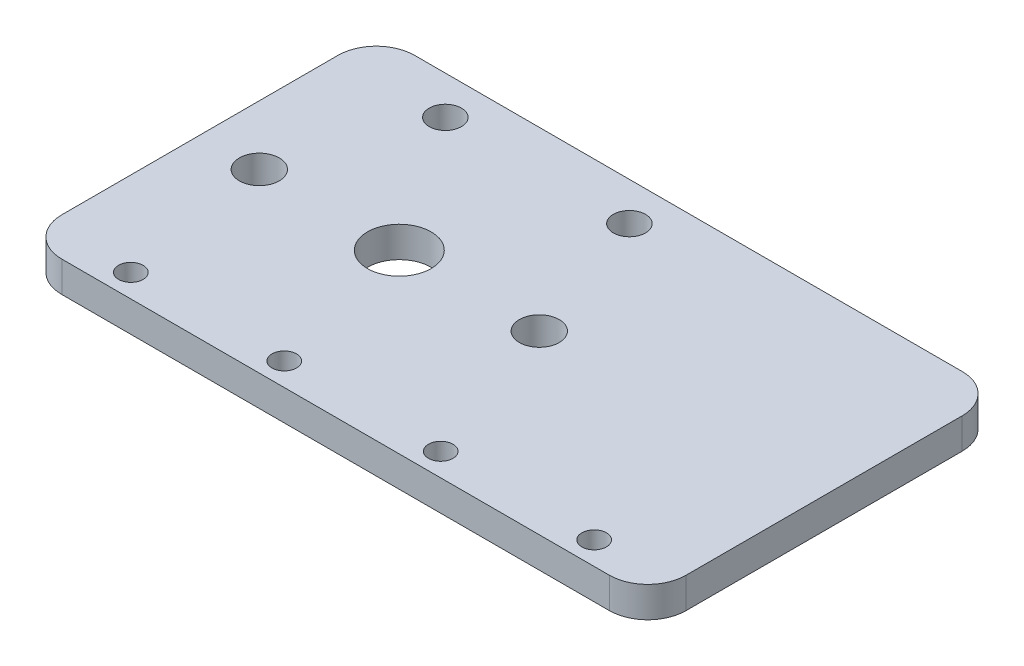
ISO-10303-21;
HEADER;
FILE_DESCRIPTION(('STEP AP214'),'2;1');
FILE_NAME('part.step','',(''),(''),'','','');
FILE_SCHEMA(('AUTOMOTIVE_DESIGN { 1 0 10303 214 1 1 1 1 }'));
ENDSEC;
DATA;
#1=APPLICATION_CONTEXT('core data for automotive mechanical design processes');
#2=APPLICATION_PROTOCOL_DEFINITION('international standard','automotive_design',2000,#1);
#3=PRODUCT_CONTEXT('',#1,'mechanical');
#4=PRODUCT('Part','Part','',(#3));
#5=PRODUCT_RELATED_PRODUCT_CATEGORY('part','',(#4));
#6=PRODUCT_DEFINITION_FORMATION('','',#4);
#7=PRODUCT_DEFINITION_CONTEXT('part definition',#1,'design');
#8=PRODUCT_DEFINITION('design','',#6,#7);
#9=PRODUCT_DEFINITION_SHAPE('','',#8);
#10=(LENGTH_UNIT() NAMED_UNIT(*) SI_UNIT(.MILLI.,.METRE.));
#11=(NAMED_UNIT(*) PLANE_ANGLE_UNIT() SI_UNIT($,.RADIAN.));
#12=(NAMED_UNIT(*) SI_UNIT($,.STERADIAN.) SOLID_ANGLE_UNIT());
#13=UNCERTAINTY_MEASURE_WITH_UNIT(LENGTH_MEASURE(1.E-05),#10,'distance_accuracy_value','');
#14=(GEOMETRIC_REPRESENTATION_CONTEXT(3) GLOBAL_UNCERTAINTY_ASSIGNED_CONTEXT((#13)) GLOBAL_UNIT_ASSIGNED_CONTEXT((#10,
#11,#12)) REPRESENTATION_CONTEXT('',''));
#15=CARTESIAN_POINT('',(0.,0.,0.));
#16=DIRECTION('',(0.,0.,1.));
#17=DIRECTION('',(1.,0.,0.));
#18=AXIS2_PLACEMENT_3D('',#15,#16,#17);
#19=CARTESIAN_POINT('',(0.,4.,0.));
#20=DIRECTION('',(0.,-1.,0.));
#21=DIRECTION('',(0.,0.,-1.));
#22=AXIS2_PLACEMENT_3D('',#19,#20,#21);
#23=PLANE('',#22);
#24=CARTESIAN_POINT('',(-15.0000000000049,4.,19.9999999999977));
#25=DIRECTION('',(0.,-1.,0.));
#26=DIRECTION('',(0.,0.,-1.));
#27=AXIS2_PLACEMENT_3D('',#24,#25,#26);
#28=CIRCLE('',#27,1.6);
#29=CARTESIAN_POINT('',(-15.0000000000049,4.,18.3999999999977));
#30=VERTEX_POINT('',#29);
#31=EDGE_CURVE('E171',#30,#30,#28,.T.);
#32=ORIENTED_EDGE('',*,*,#31,.T.);
#33=EDGE_LOOP('',(#32));
#34=FACE_BOUND('',#33,.T.);
#35=CARTESIAN_POINT('',(4.9999999999951,4.,19.9999999999977));
#36=DIRECTION('',(0.,-1.,0.));
#37=DIRECTION('',(0.,0.,-1.));
#38=AXIS2_PLACEMENT_3D('',#35,#36,#37);
#39=CIRCLE('',#38,1.6);
#40=CARTESIAN_POINT('',(4.9999999999951,4.,18.3999999999977));
#41=VERTEX_POINT('',#40);
#42=EDGE_CURVE('E282',#41,#41,#39,.T.);
#43=ORIENTED_EDGE('',*,*,#42,.T.);
#44=EDGE_LOOP('',(#43));
#45=FACE_BOUND('',#44,.T.);
#46=CARTESIAN_POINT('',(25.3999999999951,4.,19.9999999999977));
#47=DIRECTION('',(0.,-1.,0.));
#48=DIRECTION('',(0.,0.,-1.));
#49=AXIS2_PLACEMENT_3D('',#46,#47,#48);
#50=CIRCLE('',#49,1.6);
#51=CARTESIAN_POINT('',(25.3999999999951,4.,18.3999999999977));
#52=VERTEX_POINT('',#51);
#53=EDGE_CURVE('E290',#52,#52,#50,.T.);
#54=ORIENTED_EDGE('',*,*,#53,.T.);
#55=EDGE_LOOP('',(#54));
#56=FACE_BOUND('',#55,.T.);
#57=CARTESIAN_POINT('',(45.3999999999951,4.,19.9999999999977));
#58=DIRECTION('',(0.,-1.,0.));
#59=DIRECTION('',(0.,0.,-1.));
#60=AXIS2_PLACEMENT_3D('',#57,#58,#59);
#61=CIRCLE('',#60,1.6);
#62=CARTESIAN_POINT('',(45.3999999999951,4.,18.3999999999977));
#63=VERTEX_POINT('',#62);
#64=EDGE_CURVE('E296',#63,#63,#61,.T.);
#65=ORIENTED_EDGE('',*,*,#64,.T.);
#66=EDGE_LOOP('',(#65));
#67=FACE_BOUND('',#66,.T.);
#68=CARTESIAN_POINT('',(11.9999999999999,4.,-18.));
#69=DIRECTION('',(0.,1.,0.));
#70=DIRECTION('',(0.,0.,-1.));
#71=AXIS2_PLACEMENT_3D('',#68,#69,#70);
#72=CIRCLE('',#71,2.1);
#73=CARTESIAN_POINT('',(11.9999999999999,4.,-20.1));
#74=VERTEX_POINT('',#73);
#75=EDGE_CURVE('E173',#74,#74,#72,.T.);
#76=ORIENTED_EDGE('',*,*,#75,.F.);
#77=EDGE_LOOP('',(#76));
#78=FACE_BOUND('',#77,.T.);
#79=CARTESIAN_POINT('',(-12.,4.,-18.));
#80=DIRECTION('',(0.,1.,0.));
#81=DIRECTION('',(0.,0.,1.));
#82=AXIS2_PLACEMENT_3D('',#79,#80,#81);
#83=CIRCLE('',#82,2.1);
#84=CARTESIAN_POINT('',(-12.,4.,-15.9));
#85=VERTEX_POINT('',#84);
#86=EDGE_CURVE('E183',#85,#85,#83,.T.);
#87=ORIENTED_EDGE('',*,*,#86,.F.);
#88=EDGE_LOOP('',(#87));
#89=FACE_BOUND('',#88,.T.);
#90=DIRECTION('',(0.,0.,1.));
#91=VECTOR('',#90,1.);
#92=CARTESIAN_POINT('',(-26.,4.,23.));
#93=LINE('',#92,#91);
#94=CARTESIAN_POINT('',(-26.,4.,-18.));
#95=VERTEX_POINT('',#94);
#96=CARTESIAN_POINT('',(-26.,4.,18.));
#97=VERTEX_POINT('',#96);
#98=EDGE_CURVE('E135',#95,#97,#93,.T.);
#99=ORIENTED_EDGE('',*,*,#98,.T.);
#100=CARTESIAN_POINT('',(-21.,4.,18.));
#101=DIRECTION('',(0.,-1.,0.));
#102=DIRECTION('',(0.,0.,-1.));
#103=AXIS2_PLACEMENT_3D('',#100,#101,#102);
#104=CIRCLE('',#103,5.);
#105=CARTESIAN_POINT('',(-21.,4.,23.));
#106=VERTEX_POINT('',#105);
#107=EDGE_CURVE('E154',#97,#106,#104,.F.);
#108=ORIENTED_EDGE('',*,*,#107,.T.);
#109=DIRECTION('',(1.,0.,0.));
#110=VECTOR('',#109,1.);
#111=CARTESIAN_POINT('',(-26.,4.,23.));
#112=LINE('',#111,#110);
#113=CARTESIAN_POINT('',(50.3846527846708,4.,23.));
#114=VERTEX_POINT('',#113);
#115=EDGE_CURVE('E125',#106,#114,#112,.T.);
#116=ORIENTED_EDGE('',*,*,#115,.T.);
#117=CARTESIAN_POINT('',(50.3846527846709,4.,18.));
#118=DIRECTION('',(0.,-1.,0.));
#119=DIRECTION('',(0.,0.,-1.));
#120=AXIS2_PLACEMENT_3D('',#117,#118,#119);
#121=CIRCLE('',#120,5.);
#122=CARTESIAN_POINT('',(55.3846527846709,4.,18.));
#123=VERTEX_POINT('',#122);
#124=EDGE_CURVE('E152',#114,#123,#121,.F.);
#125=ORIENTED_EDGE('',*,*,#124,.T.);
#126=DIRECTION('',(0.,0.,-1.));
#127=VECTOR('',#126,1.);
#128=CARTESIAN_POINT('',(55.3846527846709,4.,23.));
#129=LINE('',#128,#127);
#130=CARTESIAN_POINT('',(55.3846527846709,4.,-18.));
#131=VERTEX_POINT('',#130);
#132=EDGE_CURVE('E167',#123,#131,#129,.T.);
#133=ORIENTED_EDGE('',*,*,#132,.T.);
#134=CARTESIAN_POINT('',(50.3846527846709,4.,-18.));
#135=DIRECTION('',(0.,-1.,0.));
#136=DIRECTION('',(0.,0.,-1.));
#137=AXIS2_PLACEMENT_3D('',#134,#135,#136);
#138=CIRCLE('',#137,5.);
#139=CARTESIAN_POINT('',(50.3846527846708,4.,-23.));
#140=VERTEX_POINT('',#139);
#141=EDGE_CURVE('E60',#131,#140,#138,.F.);
#142=ORIENTED_EDGE('',*,*,#141,.T.);
#143=DIRECTION('',(-1.,0.,0.));
#144=VECTOR('',#143,1.);
#145=CARTESIAN_POINT('',(-26.,4.,-23.));
#146=LINE('',#145,#144);
#147=CARTESIAN_POINT('',(-21.,4.,-23.));
#148=VERTEX_POINT('',#147);
#149=EDGE_CURVE('E132',#140,#148,#146,.T.);
#150=ORIENTED_EDGE('',*,*,#149,.T.);
#151=CARTESIAN_POINT('',(-21.,4.,-18.));
#152=DIRECTION('',(0.,-1.,0.));
#153=DIRECTION('',(0.,0.,-1.));
#154=AXIS2_PLACEMENT_3D('',#151,#152,#153);
#155=CIRCLE('',#154,5.);
#156=EDGE_CURVE('E149',#148,#95,#155,.F.);
#157=ORIENTED_EDGE('',*,*,#156,.T.);
#158=EDGE_LOOP('',(#99,#108,#116,#125,#133,#142,#150,#157));
#159=FACE_BOUND('',#158,.T.);
#160=CARTESIAN_POINT('',(-18.25,4.,0.));
#161=DIRECTION('',(0.,1.,0.));
#162=DIRECTION('',(0.,0.,1.));
#163=AXIS2_PLACEMENT_3D('',#160,#161,#162);
#164=CIRCLE('',#163,2.6);
#165=CARTESIAN_POINT('',(-18.25,4.,2.6));
#166=VERTEX_POINT('',#165);
#167=EDGE_CURVE('E204',#166,#166,#164,.T.);
#168=ORIENTED_EDGE('',*,*,#167,.F.);
#169=EDGE_LOOP('',(#168));
#170=FACE_BOUND('',#169,.T.);
#171=CARTESIAN_POINT('',(18.25,4.,0.));
#172=DIRECTION('',(0.,1.,0.));
#173=DIRECTION('',(0.,0.,-1.));
#174=AXIS2_PLACEMENT_3D('',#171,#172,#173);
#175=CIRCLE('',#174,2.6);
#176=CARTESIAN_POINT('',(18.25,4.,-2.6));
#177=VERTEX_POINT('',#176);
#178=EDGE_CURVE('E198',#177,#177,#175,.T.);
#179=ORIENTED_EDGE('',*,*,#178,.F.);
#180=EDGE_LOOP('',(#179));
#181=FACE_BOUND('',#180,.T.);
#182=CARTESIAN_POINT('',(0.,4.,0.));
#183=DIRECTION('',(0.,1.,0.));
#184=DIRECTION('',(0.,0.,1.));
#185=AXIS2_PLACEMENT_3D('',#182,#183,#184);
#186=CIRCLE('',#185,4.15);
#187=CARTESIAN_POINT('',(0.,4.,4.15));
#188=VERTEX_POINT('',#187);
#189=EDGE_CURVE('E192',#188,#188,#186,.T.);
#190=ORIENTED_EDGE('',*,*,#189,.F.);
#191=EDGE_LOOP('',(#190));
#192=FACE_BOUND('',#191,.T.);
#193=ADVANCED_FACE('F39',(#34,#45,#56,#67,#78,#89,#159,#170,#181,#192),#23,.F.);
#194=CARTESIAN_POINT('',(0.,0.,0.));
#195=DIRECTION('',(0.,-1.,0.));
#196=DIRECTION('',(0.,0.,-1.));
#197=AXIS2_PLACEMENT_3D('',#194,#195,#196);
#198=PLANE('',#197);
#199=CARTESIAN_POINT('',(-15.0000000000049,0.,19.9999999999977));
#200=DIRECTION('',(0.,-1.,0.));
#201=DIRECTION('',(0.,0.,-1.));
#202=AXIS2_PLACEMENT_3D('',#199,#200,#201);
#203=CIRCLE('',#202,1.6);
#204=CARTESIAN_POINT('',(-15.0000000000049,0.,18.3999999999977));
#205=VERTEX_POINT('',#204);
#206=EDGE_CURVE('E176',#205,#205,#203,.T.);
#207=ORIENTED_EDGE('',*,*,#206,.F.);
#208=EDGE_LOOP('',(#207));
#209=FACE_BOUND('',#208,.T.);
#210=CARTESIAN_POINT('',(4.9999999999951,0.,19.9999999999977));
#211=DIRECTION('',(0.,-1.,0.));
#212=DIRECTION('',(0.,0.,-1.));
#213=AXIS2_PLACEMENT_3D('',#210,#211,#212);
#214=CIRCLE('',#213,1.6);
#215=CARTESIAN_POINT('',(4.9999999999951,0.,18.3999999999977));
#216=VERTEX_POINT('',#215);
#217=EDGE_CURVE('E285',#216,#216,#214,.T.);
#218=ORIENTED_EDGE('',*,*,#217,.F.);
#219=EDGE_LOOP('',(#218));
#220=FACE_BOUND('',#219,.T.);
#221=CARTESIAN_POINT('',(25.3999999999951,0.,19.9999999999977));
#222=DIRECTION('',(0.,-1.,0.));
#223=DIRECTION('',(0.,0.,-1.));
#224=AXIS2_PLACEMENT_3D('',#221,#222,#223);
#225=CIRCLE('',#224,1.6);
#226=CARTESIAN_POINT('',(25.3999999999951,0.,18.3999999999977));
#227=VERTEX_POINT('',#226);
#228=EDGE_CURVE('E293',#227,#227,#225,.T.);
#229=ORIENTED_EDGE('',*,*,#228,.F.);
#230=EDGE_LOOP('',(#229));
#231=FACE_BOUND('',#230,.T.);
#232=CARTESIAN_POINT('',(45.3999999999951,0.,19.9999999999977));
#233=DIRECTION('',(0.,-1.,0.));
#234=DIRECTION('',(0.,0.,-1.));
#235=AXIS2_PLACEMENT_3D('',#232,#233,#234);
#236=CIRCLE('',#235,1.6);
#237=CARTESIAN_POINT('',(45.3999999999951,0.,18.3999999999977));
#238=VERTEX_POINT('',#237);
#239=EDGE_CURVE('E298',#238,#238,#236,.T.);
#240=ORIENTED_EDGE('',*,*,#239,.F.);
#241=EDGE_LOOP('',(#240));
#242=FACE_BOUND('',#241,.T.);
#243=CARTESIAN_POINT('',(11.9999999999999,0.,-18.));
#244=DIRECTION('',(0.,1.,0.));
#245=DIRECTION('',(0.,0.,-1.));
#246=AXIS2_PLACEMENT_3D('',#243,#244,#245);
#247=CIRCLE('',#246,2.1);
#248=CARTESIAN_POINT('',(11.9999999999999,0.,-20.1));
#249=VERTEX_POINT('',#248);
#250=EDGE_CURVE('E180',#249,#249,#247,.T.);
#251=ORIENTED_EDGE('',*,*,#250,.T.);
#252=EDGE_LOOP('',(#251));
#253=FACE_BOUND('',#252,.T.);
#254=CARTESIAN_POINT('',(-12.,0.,-18.));
#255=DIRECTION('',(0.,1.,0.));
#256=DIRECTION('',(0.,0.,1.));
#257=AXIS2_PLACEMENT_3D('',#254,#255,#256);
#258=CIRCLE('',#257,2.1);
#259=CARTESIAN_POINT('',(-12.,0.,-15.9));
#260=VERTEX_POINT('',#259);
#261=EDGE_CURVE('E186',#260,#260,#258,.T.);
#262=ORIENTED_EDGE('',*,*,#261,.T.);
#263=EDGE_LOOP('',(#262));
#264=FACE_BOUND('',#263,.T.);
#265=CARTESIAN_POINT('',(18.25,0.,0.));
#266=DIRECTION('',(0.,1.,0.));
#267=DIRECTION('',(0.,0.,-1.));
#268=AXIS2_PLACEMENT_3D('',#265,#266,#267);
#269=CIRCLE('',#268,2.6);
#270=CARTESIAN_POINT('',(18.25,0.,-2.6));
#271=VERTEX_POINT('',#270);
#272=EDGE_CURVE('E195',#271,#271,#269,.T.);
#273=ORIENTED_EDGE('',*,*,#272,.T.);
#274=EDGE_LOOP('',(#273));
#275=FACE_BOUND('',#274,.T.);
#276=DIRECTION('',(1.,0.,0.));
#277=VECTOR('',#276,1.);
#278=CARTESIAN_POINT('',(-26.,0.,23.));
#279=LINE('',#278,#277);
#280=CARTESIAN_POINT('',(-21.,0.,23.));
#281=VERTEX_POINT('',#280);
#282=CARTESIAN_POINT('',(50.3846527846708,0.,23.));
#283=VERTEX_POINT('',#282);
#284=EDGE_CURVE('E122',#281,#283,#279,.T.);
#285=ORIENTED_EDGE('',*,*,#284,.F.);
#286=CARTESIAN_POINT('',(-21.,0.,18.));
#287=DIRECTION('',(0.,-1.,0.));
#288=DIRECTION('',(0.,0.,-1.));
#289=AXIS2_PLACEMENT_3D('',#286,#287,#288);
#290=CIRCLE('',#289,5.);
#291=CARTESIAN_POINT('',(-26.,0.,18.));
#292=VERTEX_POINT('',#291);
#293=EDGE_CURVE('E105',#281,#292,#290,.T.);
#294=ORIENTED_EDGE('',*,*,#293,.T.);
#295=DIRECTION('',(0.,0.,1.));
#296=VECTOR('',#295,1.);
#297=CARTESIAN_POINT('',(-26.,0.,23.));
#298=LINE('',#297,#296);
#299=CARTESIAN_POINT('',(-26.,0.,-18.));
#300=VERTEX_POINT('',#299);
#301=EDGE_CURVE('E133',#300,#292,#298,.T.);
#302=ORIENTED_EDGE('',*,*,#301,.F.);
#303=CARTESIAN_POINT('',(-21.,0.,-18.));
#304=DIRECTION('',(0.,-1.,0.));
#305=DIRECTION('',(0.,0.,-1.));
#306=AXIS2_PLACEMENT_3D('',#303,#304,#305);
#307=CIRCLE('',#306,5.);
#308=CARTESIAN_POINT('',(-21.,0.,-23.));
#309=VERTEX_POINT('',#308);
#310=EDGE_CURVE('E126',#300,#309,#307,.T.);
#311=ORIENTED_EDGE('',*,*,#310,.T.);
#312=DIRECTION('',(-1.,0.,0.));
#313=VECTOR('',#312,1.);
#314=CARTESIAN_POINT('',(-26.,0.,-23.));
#315=LINE('',#314,#313);
#316=CARTESIAN_POINT('',(50.3846527846708,0.,-23.));
#317=VERTEX_POINT('',#316);
#318=EDGE_CURVE('E137',#317,#309,#315,.T.);
#319=ORIENTED_EDGE('',*,*,#318,.F.);
#320=CARTESIAN_POINT('',(50.3846527846709,0.,-18.));
#321=DIRECTION('',(0.,-1.,0.));
#322=DIRECTION('',(0.,0.,-1.));
#323=AXIS2_PLACEMENT_3D('',#320,#321,#322);
#324=CIRCLE('',#323,5.);
#325=CARTESIAN_POINT('',(55.3846527846709,0.,-18.));
#326=VERTEX_POINT('',#325);
#327=EDGE_CURVE('E143',#317,#326,#324,.T.);
#328=ORIENTED_EDGE('',*,*,#327,.T.);
#329=DIRECTION('',(0.,0.,1.));
#330=VECTOR('',#329,1.);
#331=CARTESIAN_POINT('',(55.3846527846709,0.,23.));
#332=LINE('',#331,#330);
#333=CARTESIAN_POINT('',(55.3846527846709,0.,18.));
#334=VERTEX_POINT('',#333);
#335=EDGE_CURVE('E165',#326,#334,#332,.T.);
#336=ORIENTED_EDGE('',*,*,#335,.T.);
#337=CARTESIAN_POINT('',(50.3846527846709,0.,18.));
#338=DIRECTION('',(0.,-1.,0.));
#339=DIRECTION('',(0.,0.,-1.));
#340=AXIS2_PLACEMENT_3D('',#337,#338,#339);
#341=CIRCLE('',#340,5.);
#342=EDGE_CURVE('E116',#334,#283,#341,.T.);
#343=ORIENTED_EDGE('',*,*,#342,.T.);
#344=EDGE_LOOP('',(#285,#294,#302,#311,#319,#328,#336,#343));
#345=FACE_BOUND('',#344,.T.);
#346=CARTESIAN_POINT('',(-18.25,0.,0.));
#347=DIRECTION('',(0.,1.,0.));
#348=DIRECTION('',(0.,0.,1.));
#349=AXIS2_PLACEMENT_3D('',#346,#347,#348);
#350=CIRCLE('',#349,2.6);
#351=CARTESIAN_POINT('',(-18.25,0.,2.6));
#352=VERTEX_POINT('',#351);
#353=EDGE_CURVE('E201',#352,#352,#350,.T.);
#354=ORIENTED_EDGE('',*,*,#353,.T.);
#355=EDGE_LOOP('',(#354));
#356=FACE_BOUND('',#355,.T.);
#357=CARTESIAN_POINT('',(0.,0.,0.));
#358=DIRECTION('',(0.,1.,0.));
#359=DIRECTION('',(0.,0.,1.));
#360=AXIS2_PLACEMENT_3D('',#357,#358,#359);
#361=CIRCLE('',#360,4.15);
#362=CARTESIAN_POINT('',(0.,0.,4.15));
#363=VERTEX_POINT('',#362);
#364=EDGE_CURVE('E189',#363,#363,#361,.T.);
#365=ORIENTED_EDGE('',*,*,#364,.T.);
#366=EDGE_LOOP('',(#365));
#367=FACE_BOUND('',#366,.T.);
#368=ADVANCED_FACE('F129',(#209,#220,#231,#242,#253,#264,#275,#345,#356,#367),#198,.T.);
#369=CARTESIAN_POINT('',(-26.,4.,-23.));
#370=DIRECTION('',(0.,0.,1.));
#371=DIRECTION('',(1.,0.,0.));
#372=AXIS2_PLACEMENT_3D('',#369,#370,#371);
#373=PLANE('',#372);
#374=ORIENTED_EDGE('',*,*,#149,.F.);
#375=DIRECTION('',(0.,-1.,0.));
#376=VECTOR('',#375,1.);
#377=CARTESIAN_POINT('',(50.3846527846709,0.,-23.));
#378=LINE('',#377,#376);
#379=EDGE_CURVE('E11',#140,#317,#378,.T.);
#380=ORIENTED_EDGE('',*,*,#379,.T.);
#381=ORIENTED_EDGE('',*,*,#318,.T.);
#382=DIRECTION('',(0.,-1.,0.));
#383=VECTOR('',#382,1.);
#384=CARTESIAN_POINT('',(-21.,4.,-23.));
#385=LINE('',#384,#383);
#386=EDGE_CURVE('E47',#309,#148,#385,.F.);
#387=ORIENTED_EDGE('',*,*,#386,.T.);
#388=EDGE_LOOP('',(#374,#380,#381,#387));
#389=FACE_BOUND('',#388,.T.);
#390=ADVANCED_FACE('F211',(#389),#373,.F.);
#391=CARTESIAN_POINT('',(-26.,4.,23.));
#392=DIRECTION('',(1.,0.,0.));
#393=DIRECTION('',(0.,0.,-1.));
#394=AXIS2_PLACEMENT_3D('',#391,#392,#393);
#395=PLANE('',#394);
#396=ORIENTED_EDGE('',*,*,#301,.T.);
#397=DIRECTION('',(0.,-1.,0.));
#398=VECTOR('',#397,1.);
#399=CARTESIAN_POINT('',(-26.,4.,18.));
#400=LINE('',#399,#398);
#401=EDGE_CURVE('E110',#292,#97,#400,.F.);
#402=ORIENTED_EDGE('',*,*,#401,.T.);
#403=ORIENTED_EDGE('',*,*,#98,.F.);
#404=DIRECTION('',(0.,-1.,0.));
#405=VECTOR('',#404,1.);
#406=CARTESIAN_POINT('',(-26.,4.,-18.));
#407=LINE('',#406,#405);
#408=EDGE_CURVE('E115',#95,#300,#407,.T.);
#409=ORIENTED_EDGE('',*,*,#408,.T.);
#410=EDGE_LOOP('',(#396,#402,#403,#409));
#411=FACE_BOUND('',#410,.T.);
#412=ADVANCED_FACE('F219',(#411),#395,.F.);
#413=CARTESIAN_POINT('',(-26.,4.,23.));
#414=DIRECTION('',(0.,0.,-1.));
#415=DIRECTION('',(-1.,0.,0.));
#416=AXIS2_PLACEMENT_3D('',#413,#414,#415);
#417=PLANE('',#416);
#418=ORIENTED_EDGE('',*,*,#115,.F.);
#419=DIRECTION('',(0.,-1.,0.));
#420=VECTOR('',#419,1.);
#421=CARTESIAN_POINT('',(-21.,4.,23.));
#422=LINE('',#421,#420);
#423=EDGE_CURVE('E109',#106,#281,#422,.T.);
#424=ORIENTED_EDGE('',*,*,#423,.T.);
#425=ORIENTED_EDGE('',*,*,#284,.T.);
#426=DIRECTION('',(0.,-1.,0.));
#427=VECTOR('',#426,1.);
#428=CARTESIAN_POINT('',(50.3846527846709,4.,23.));
#429=LINE('',#428,#427);
#430=EDGE_CURVE('E127',#283,#114,#429,.F.);
#431=ORIENTED_EDGE('',*,*,#430,.T.);
#432=EDGE_LOOP('',(#418,#424,#425,#431));
#433=FACE_BOUND('',#432,.T.);
#434=ADVANCED_FACE('F121',(#433),#417,.F.);
#435=CARTESIAN_POINT('',(-18.25,4.,0.));
#436=DIRECTION('',(0.,-1.,0.));
#437=DIRECTION('',(0.,0.,-1.));
#438=AXIS2_PLACEMENT_3D('',#435,#436,#437);
#439=CYLINDRICAL_SURFACE('',#438,2.6);
#440=ORIENTED_EDGE('',*,*,#167,.T.);
#441=EDGE_LOOP('',(#440));
#442=FACE_BOUND('',#441,.T.);
#443=ORIENTED_EDGE('',*,*,#353,.F.);
#444=EDGE_LOOP('',(#443));
#445=FACE_BOUND('',#444,.T.);
#446=ADVANCED_FACE('F226',(#442,#445),#439,.F.);
#447=CARTESIAN_POINT('',(18.25,4.,0.));
#448=DIRECTION('',(0.,-1.,0.));
#449=DIRECTION('',(0.,0.,-1.));
#450=AXIS2_PLACEMENT_3D('',#447,#448,#449);
#451=CYLINDRICAL_SURFACE('',#450,2.6);
#452=ORIENTED_EDGE('',*,*,#178,.T.);
#453=EDGE_LOOP('',(#452));
#454=FACE_BOUND('',#453,.T.);
#455=ORIENTED_EDGE('',*,*,#272,.F.);
#456=EDGE_LOOP('',(#455));
#457=FACE_BOUND('',#456,.T.);
#458=ADVANCED_FACE('F242',(#454,#457),#451,.F.);
#459=CARTESIAN_POINT('',(0.,4.,0.));
#460=DIRECTION('',(0.,-1.,0.));
#461=DIRECTION('',(0.,0.,-1.));
#462=AXIS2_PLACEMENT_3D('',#459,#460,#461);
#463=CYLINDRICAL_SURFACE('',#462,4.15);
#464=ORIENTED_EDGE('',*,*,#189,.T.);
#465=EDGE_LOOP('',(#464));
#466=FACE_BOUND('',#465,.T.);
#467=ORIENTED_EDGE('',*,*,#364,.F.);
#468=EDGE_LOOP('',(#467));
#469=FACE_BOUND('',#468,.T.);
#470=ADVANCED_FACE('F246',(#466,#469),#463,.F.);
#471=CARTESIAN_POINT('',(-12.,0.,-18.));
#472=DIRECTION('',(0.,1.,0.));
#473=DIRECTION('',(0.,0.,1.));
#474=AXIS2_PLACEMENT_3D('',#471,#472,#473);
#475=CYLINDRICAL_SURFACE('',#474,2.1);
#476=ORIENTED_EDGE('',*,*,#261,.F.);
#477=EDGE_LOOP('',(#476));
#478=FACE_BOUND('',#477,.T.);
#479=ORIENTED_EDGE('',*,*,#86,.T.);
#480=EDGE_LOOP('',(#479));
#481=FACE_BOUND('',#480,.T.);
#482=ADVANCED_FACE('F250',(#478,#481),#475,.F.);
#483=CARTESIAN_POINT('',(11.9999999999999,0.,-18.));
#484=DIRECTION('',(0.,1.,0.));
#485=DIRECTION('',(0.,0.,1.));
#486=AXIS2_PLACEMENT_3D('',#483,#484,#485);
#487=CYLINDRICAL_SURFACE('',#486,2.1);
#488=ORIENTED_EDGE('',*,*,#250,.F.);
#489=EDGE_LOOP('',(#488));
#490=FACE_BOUND('',#489,.T.);
#491=ORIENTED_EDGE('',*,*,#75,.T.);
#492=EDGE_LOOP('',(#491));
#493=FACE_BOUND('',#492,.T.);
#494=ADVANCED_FACE('F254',(#490,#493),#487,.F.);
#495=CARTESIAN_POINT('',(55.3846527846709,58.584410038725,23.));
#496=DIRECTION('',(1.,0.,0.));
#497=DIRECTION('',(0.,0.,-1.));
#498=AXIS2_PLACEMENT_3D('',#495,#496,#497);
#499=PLANE('',#498);
#500=ORIENTED_EDGE('',*,*,#132,.F.);
#501=DIRECTION('',(0.,-1.,0.));
#502=VECTOR('',#501,1.);
#503=CARTESIAN_POINT('',(55.3846527846709,0.,18.));
#504=LINE('',#503,#502);
#505=EDGE_CURVE('E158',#123,#334,#504,.T.);
#506=ORIENTED_EDGE('',*,*,#505,.T.);
#507=ORIENTED_EDGE('',*,*,#335,.F.);
#508=DIRECTION('',(0.,-1.,0.));
#509=VECTOR('',#508,1.);
#510=CARTESIAN_POINT('',(55.3846527846709,4.,-18.));
#511=LINE('',#510,#509);
#512=EDGE_CURVE('E156',#326,#131,#511,.F.);
#513=ORIENTED_EDGE('',*,*,#512,.T.);
#514=EDGE_LOOP('',(#500,#506,#507,#513));
#515=FACE_BOUND('',#514,.T.);
#516=ADVANCED_FACE('F164',(#515),#499,.T.);
#517=CARTESIAN_POINT('',(-21.,4.,18.));
#518=DIRECTION('',(0.,-1.,0.));
#519=DIRECTION('',(0.,0.,-1.));
#520=AXIS2_PLACEMENT_3D('',#517,#518,#519);
#521=CYLINDRICAL_SURFACE('',#520,5.);
#522=ORIENTED_EDGE('',*,*,#107,.F.);
#523=ORIENTED_EDGE('',*,*,#401,.F.);
#524=ORIENTED_EDGE('',*,*,#293,.F.);
#525=ORIENTED_EDGE('',*,*,#423,.F.);
#526=EDGE_LOOP('',(#522,#523,#524,#525));
#527=FACE_BOUND('',#526,.T.);
#528=ADVANCED_FACE('F108',(#527),#521,.T.);
#529=CARTESIAN_POINT('',(50.3846527846709,58.584410038725,18.));
#530=DIRECTION('',(0.,1.,0.));
#531=DIRECTION('',(0.,0.,1.));
#532=AXIS2_PLACEMENT_3D('',#529,#530,#531);
#533=CYLINDRICAL_SURFACE('',#532,5.);
#534=ORIENTED_EDGE('',*,*,#124,.F.);
#535=ORIENTED_EDGE('',*,*,#430,.F.);
#536=ORIENTED_EDGE('',*,*,#342,.F.);
#537=ORIENTED_EDGE('',*,*,#505,.F.);
#538=EDGE_LOOP('',(#534,#535,#536,#537));
#539=FACE_BOUND('',#538,.T.);
#540=ADVANCED_FACE('F350',(#539),#533,.T.);
#541=CARTESIAN_POINT('',(50.3846527846709,4.,-18.));
#542=DIRECTION('',(0.,1.,0.));
#543=DIRECTION('',(0.,0.,1.));
#544=AXIS2_PLACEMENT_3D('',#541,#542,#543);
#545=CYLINDRICAL_SURFACE('',#544,5.);
#546=ORIENTED_EDGE('',*,*,#141,.F.);
#547=ORIENTED_EDGE('',*,*,#512,.F.);
#548=ORIENTED_EDGE('',*,*,#327,.F.);
#549=ORIENTED_EDGE('',*,*,#379,.F.);
#550=EDGE_LOOP('',(#546,#547,#548,#549));
#551=FACE_BOUND('',#550,.T.);
#552=ADVANCED_FACE('F344',(#551),#545,.T.);
#553=CARTESIAN_POINT('',(-21.,4.,-18.));
#554=DIRECTION('',(0.,-1.,0.));
#555=DIRECTION('',(0.,0.,-1.));
#556=AXIS2_PLACEMENT_3D('',#553,#554,#555);
#557=CYLINDRICAL_SURFACE('',#556,5.);
#558=ORIENTED_EDGE('',*,*,#156,.F.);
#559=ORIENTED_EDGE('',*,*,#386,.F.);
#560=ORIENTED_EDGE('',*,*,#310,.F.);
#561=ORIENTED_EDGE('',*,*,#408,.F.);
#562=EDGE_LOOP('',(#558,#559,#560,#561));
#563=FACE_BOUND('',#562,.T.);
#564=ADVANCED_FACE('F41',(#563),#557,.T.);
#565=CARTESIAN_POINT('',(45.3999999999951,4.,19.9999999999977));
#566=DIRECTION('',(0.,-1.,0.));
#567=DIRECTION('',(0.,0.,-1.));
#568=AXIS2_PLACEMENT_3D('',#565,#566,#567);
#569=CYLINDRICAL_SURFACE('',#568,1.6);
#570=ORIENTED_EDGE('',*,*,#64,.F.);
#571=EDGE_LOOP('',(#570));
#572=FACE_BOUND('',#571,.T.);
#573=ORIENTED_EDGE('',*,*,#239,.T.);
#574=EDGE_LOOP('',(#573));
#575=FACE_BOUND('',#574,.T.);
#576=ADVANCED_FACE('F261',(#572,#575),#569,.F.);
#577=CARTESIAN_POINT('',(25.3999999999951,4.,19.9999999999977));
#578=DIRECTION('',(0.,-1.,0.));
#579=DIRECTION('',(0.,0.,-1.));
#580=AXIS2_PLACEMENT_3D('',#577,#578,#579);
#581=CYLINDRICAL_SURFACE('',#580,1.6);
#582=ORIENTED_EDGE('',*,*,#53,.F.);
#583=EDGE_LOOP('',(#582));
#584=FACE_BOUND('',#583,.T.);
#585=ORIENTED_EDGE('',*,*,#228,.T.);
#586=EDGE_LOOP('',(#585));
#587=FACE_BOUND('',#586,.T.);
#588=ADVANCED_FACE('F264',(#584,#587),#581,.F.);
#589=CARTESIAN_POINT('',(4.9999999999951,4.,19.9999999999977));
#590=DIRECTION('',(0.,-1.,0.));
#591=DIRECTION('',(0.,0.,-1.));
#592=AXIS2_PLACEMENT_3D('',#589,#590,#591);
#593=CYLINDRICAL_SURFACE('',#592,1.6);
#594=ORIENTED_EDGE('',*,*,#42,.F.);
#595=EDGE_LOOP('',(#594));
#596=FACE_BOUND('',#595,.T.);
#597=ORIENTED_EDGE('',*,*,#217,.T.);
#598=EDGE_LOOP('',(#597));
#599=FACE_BOUND('',#598,.T.);
#600=ADVANCED_FACE('F268',(#596,#599),#593,.F.);
#601=CARTESIAN_POINT('',(-15.0000000000049,4.,19.9999999999977));
#602=DIRECTION('',(0.,-1.,0.));
#603=DIRECTION('',(0.,0.,-1.));
#604=AXIS2_PLACEMENT_3D('',#601,#602,#603);
#605=CYLINDRICAL_SURFACE('',#604,1.6);
#606=ORIENTED_EDGE('',*,*,#31,.F.);
#607=EDGE_LOOP('',(#606));
#608=FACE_BOUND('',#607,.T.);
#609=ORIENTED_EDGE('',*,*,#206,.T.);
#610=EDGE_LOOP('',(#609));
#611=FACE_BOUND('',#610,.T.);
#612=ADVANCED_FACE('F272',(#608,#611),#605,.F.);
#613=CLOSED_SHELL('',(#193,#368,#390,#412,#434,#446,#458,#470,#482,#494,#516,#528,#540,#552,
#564,#576,#588,#600,#612));
#614=MANIFOLD_SOLID_BREP('B2',#613);
#615=ADVANCED_BREP_SHAPE_REPRESENTATION('',(#18,#614),#14);
#616=SHAPE_DEFINITION_REPRESENTATION(#9,#615);
ENDSEC;
END-ISO-10303-21;
